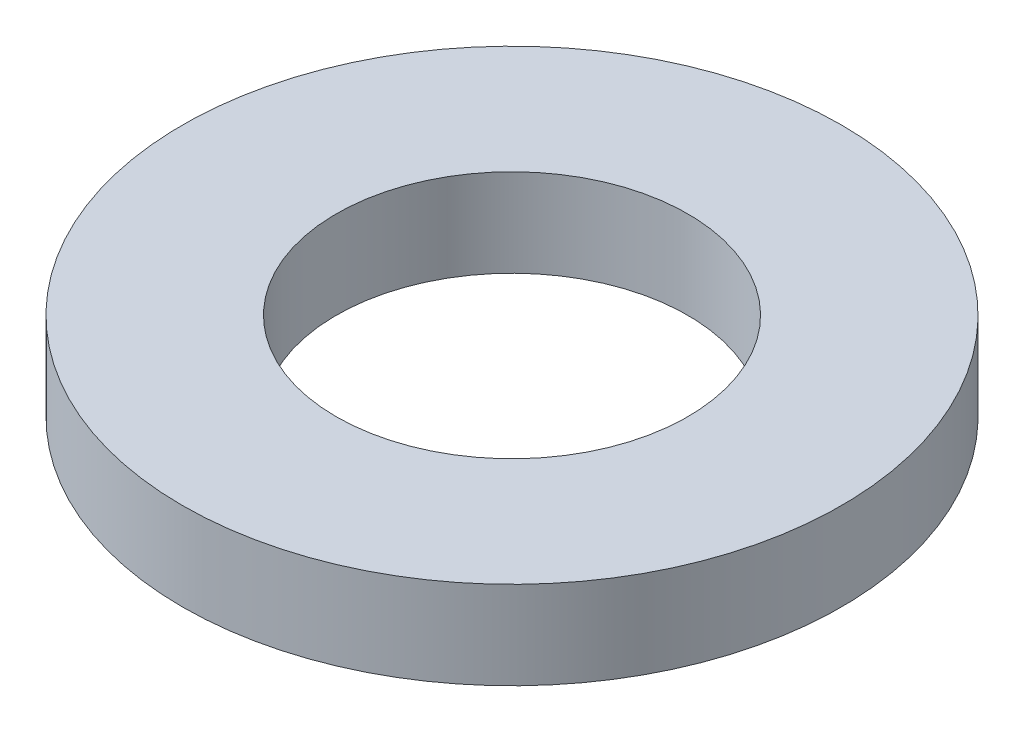
ISO-10303-21;
HEADER;
FILE_DESCRIPTION(('STEP AP214'),'2;1');
FILE_NAME('part.step','',(''),(''),'','','');
FILE_SCHEMA(('AUTOMOTIVE_DESIGN { 1 0 10303 214 1 1 1 1 }'));
ENDSEC;
DATA;
#1=APPLICATION_CONTEXT('core data for automotive mechanical design processes');
#2=APPLICATION_PROTOCOL_DEFINITION('international standard','automotive_design',2000,#1);
#3=PRODUCT_CONTEXT('',#1,'mechanical');
#4=PRODUCT('Part','Part','',(#3));
#5=PRODUCT_RELATED_PRODUCT_CATEGORY('part','',(#4));
#6=PRODUCT_DEFINITION_FORMATION('','',#4);
#7=PRODUCT_DEFINITION_CONTEXT('part definition',#1,'design');
#8=PRODUCT_DEFINITION('design','',#6,#7);
#9=PRODUCT_DEFINITION_SHAPE('','',#8);
#10=(LENGTH_UNIT() NAMED_UNIT(*) SI_UNIT(.MILLI.,.METRE.));
#11=(NAMED_UNIT(*) PLANE_ANGLE_UNIT() SI_UNIT($,.RADIAN.));
#12=(NAMED_UNIT(*) SI_UNIT($,.STERADIAN.) SOLID_ANGLE_UNIT());
#13=UNCERTAINTY_MEASURE_WITH_UNIT(LENGTH_MEASURE(1.E-05),#10,'distance_accuracy_value','');
#14=(GEOMETRIC_REPRESENTATION_CONTEXT(3) GLOBAL_UNCERTAINTY_ASSIGNED_CONTEXT((#13)) GLOBAL_UNIT_ASSIGNED_CONTEXT((#10,
#11,#12)) REPRESENTATION_CONTEXT('',''));
#15=CARTESIAN_POINT('',(0.,0.,0.));
#16=DIRECTION('',(0.,0.,1.));
#17=DIRECTION('',(1.,0.,0.));
#18=AXIS2_PLACEMENT_3D('',#15,#16,#17);
#19=CARTESIAN_POINT('',(0.,20.,0.));
#20=DIRECTION('',(0.,-1.,0.));
#21=DIRECTION('',(0.,0.,-1.));
#22=AXIS2_PLACEMENT_3D('',#19,#20,#21);
#23=CYLINDRICAL_SURFACE('',#22,75.);
#24=CARTESIAN_POINT('',(0.,20.,0.));
#25=DIRECTION('',(0.,1.,0.));
#26=DIRECTION('',(0.,0.,1.));
#27=AXIS2_PLACEMENT_3D('',#24,#25,#26);
#28=CIRCLE('',#27,75.);
#29=CARTESIAN_POINT('',(0.,20.,75.));
#30=VERTEX_POINT('',#29);
#31=EDGE_CURVE('E10',#30,#30,#28,.T.);
#32=ORIENTED_EDGE('',*,*,#31,.F.);
#33=EDGE_LOOP('',(#32));
#34=FACE_BOUND('',#33,.T.);
#35=CARTESIAN_POINT('',(0.,0.,0.));
#36=DIRECTION('',(0.,1.,0.));
#37=DIRECTION('',(0.,0.,1.));
#38=AXIS2_PLACEMENT_3D('',#35,#36,#37);
#39=CIRCLE('',#38,75.);
#40=CARTESIAN_POINT('',(0.,0.,75.));
#41=VERTEX_POINT('',#40);
#42=EDGE_CURVE('E37',#41,#41,#39,.T.);
#43=ORIENTED_EDGE('',*,*,#42,.T.);
#44=EDGE_LOOP('',(#43));
#45=FACE_BOUND('',#44,.T.);
#46=ADVANCED_FACE('F40',(#34,#45),#23,.T.);
#47=CARTESIAN_POINT('',(0.,20.,0.));
#48=DIRECTION('',(0.,1.,0.));
#49=DIRECTION('',(0.,0.,1.));
#50=AXIS2_PLACEMENT_3D('',#47,#48,#49);
#51=PLANE('',#50);
#52=CARTESIAN_POINT('',(0.,20.,0.));
#53=DIRECTION('',(0.,1.,0.));
#54=DIRECTION('',(0.,0.,1.));
#55=AXIS2_PLACEMENT_3D('',#52,#53,#54);
#56=CIRCLE('',#55,40.);
#57=CARTESIAN_POINT('',(0.,20.,40.));
#58=VERTEX_POINT('',#57);
#59=EDGE_CURVE('E50',#58,#58,#56,.T.);
#60=ORIENTED_EDGE('',*,*,#59,.F.);
#61=EDGE_LOOP('',(#60));
#62=FACE_BOUND('',#61,.T.);
#63=ORIENTED_EDGE('',*,*,#31,.T.);
#64=EDGE_LOOP('',(#63));
#65=FACE_BOUND('',#64,.T.);
#66=ADVANCED_FACE('F59',(#62,#65),#51,.T.);
#67=CARTESIAN_POINT('',(0.,0.,0.));
#68=DIRECTION('',(0.,1.,0.));
#69=DIRECTION('',(0.,0.,1.));
#70=AXIS2_PLACEMENT_3D('',#67,#68,#69);
#71=PLANE('',#70);
#72=CARTESIAN_POINT('',(0.,0.,0.));
#73=DIRECTION('',(0.,1.,0.));
#74=DIRECTION('',(0.,0.,1.));
#75=AXIS2_PLACEMENT_3D('',#72,#73,#74);
#76=CIRCLE('',#75,40.);
#77=CARTESIAN_POINT('',(0.,0.,40.));
#78=VERTEX_POINT('',#77);
#79=EDGE_CURVE('E47',#78,#78,#76,.T.);
#80=ORIENTED_EDGE('',*,*,#79,.T.);
#81=EDGE_LOOP('',(#80));
#82=FACE_BOUND('',#81,.T.);
#83=ORIENTED_EDGE('',*,*,#42,.F.);
#84=EDGE_LOOP('',(#83));
#85=FACE_BOUND('',#84,.T.);
#86=ADVANCED_FACE('F58',(#82,#85),#71,.F.);
#87=CARTESIAN_POINT('',(0.,20.,0.));
#88=DIRECTION('',(0.,-1.,0.));
#89=DIRECTION('',(0.,0.,-1.));
#90=AXIS2_PLACEMENT_3D('',#87,#88,#89);
#91=CYLINDRICAL_SURFACE('',#90,40.);
#92=ORIENTED_EDGE('',*,*,#59,.T.);
#93=EDGE_LOOP('',(#92));
#94=FACE_BOUND('',#93,.T.);
#95=ORIENTED_EDGE('',*,*,#79,.F.);
#96=EDGE_LOOP('',(#95));
#97=FACE_BOUND('',#96,.T.);
#98=ADVANCED_FACE('F54',(#94,#97),#91,.F.);
#99=CLOSED_SHELL('',(#46,#66,#86,#98));
#100=MANIFOLD_SOLID_BREP('B2',#99);
#101=ADVANCED_BREP_SHAPE_REPRESENTATION('',(#18,#100),#14);
#102=SHAPE_DEFINITION_REPRESENTATION(#9,#101);
ENDSEC;
END-ISO-10303-21;
